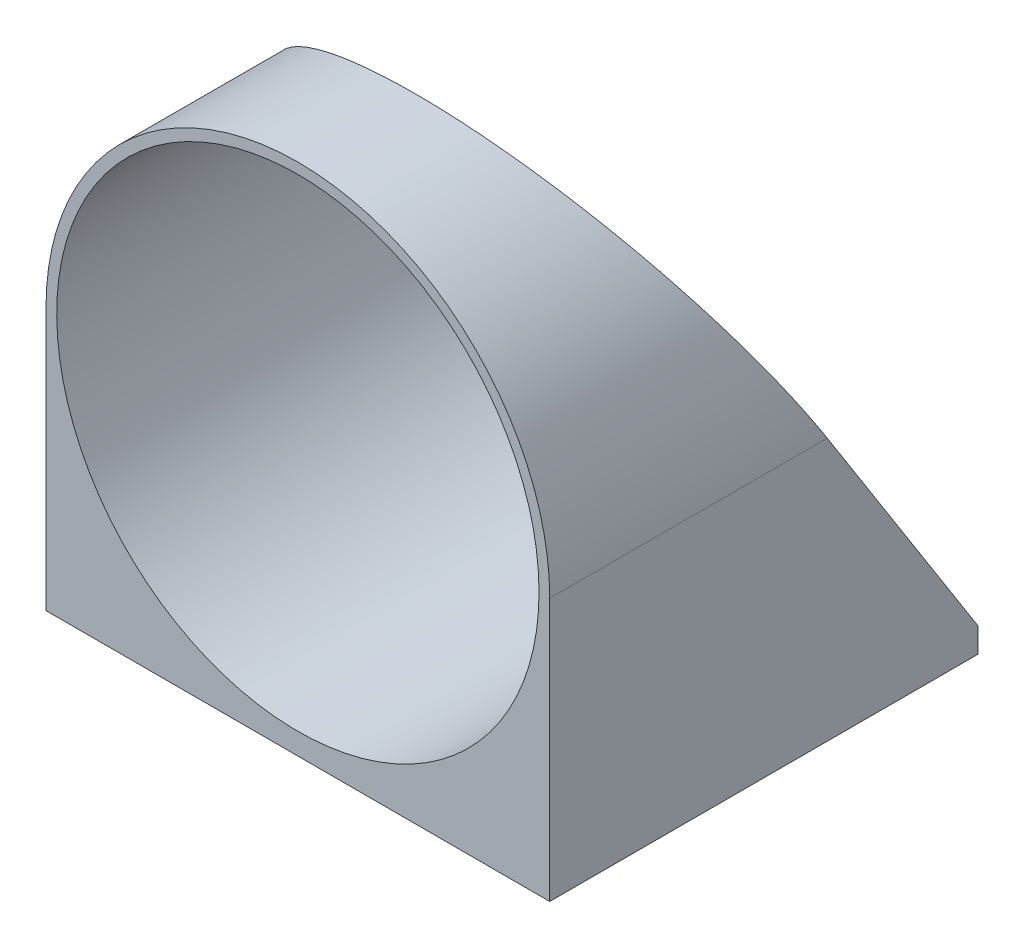
ISO-10303-21;
HEADER;
FILE_DESCRIPTION(('STEP AP214'),'2;1');
FILE_NAME('part.step','',(''),(''),'','','');
FILE_SCHEMA(('AUTOMOTIVE_DESIGN { 1 0 10303 214 1 1 1 1 }'));
ENDSEC;
DATA;
#1=APPLICATION_CONTEXT('core data for automotive mechanical design processes');
#2=APPLICATION_PROTOCOL_DEFINITION('international standard','automotive_design',2000,#1);
#3=PRODUCT_CONTEXT('',#1,'mechanical');
#4=PRODUCT('Part','Part','',(#3));
#5=PRODUCT_RELATED_PRODUCT_CATEGORY('part','',(#4));
#6=PRODUCT_DEFINITION_FORMATION('','',#4);
#7=PRODUCT_DEFINITION_CONTEXT('part definition',#1,'design');
#8=PRODUCT_DEFINITION('design','',#6,#7);
#9=PRODUCT_DEFINITION_SHAPE('','',#8);
#10=(LENGTH_UNIT() NAMED_UNIT(*) SI_UNIT(.MILLI.,.METRE.));
#11=(NAMED_UNIT(*) PLANE_ANGLE_UNIT() SI_UNIT($,.RADIAN.));
#12=(NAMED_UNIT(*) SI_UNIT($,.STERADIAN.) SOLID_ANGLE_UNIT());
#13=UNCERTAINTY_MEASURE_WITH_UNIT(LENGTH_MEASURE(1.E-05),#10,'distance_accuracy_value','');
#14=(GEOMETRIC_REPRESENTATION_CONTEXT(3) GLOBAL_UNCERTAINTY_ASSIGNED_CONTEXT((#13)) GLOBAL_UNIT_ASSIGNED_CONTEXT((#10,
#11,#12)) REPRESENTATION_CONTEXT('',''));
#15=CARTESIAN_POINT('',(0.,0.,0.));
#16=DIRECTION('',(0.,0.,1.));
#17=DIRECTION('',(1.,0.,0.));
#18=AXIS2_PLACEMENT_3D('',#15,#16,#17);
#19=CARTESIAN_POINT('',(0.,0.,-816.540159845395));
#20=DIRECTION('',(0.,0.,1.));
#21=DIRECTION('',(1.,0.,0.));
#22=AXIS2_PLACEMENT_3D('',#19,#20,#21);
#23=PLANE('',#22);
#24=CARTESIAN_POINT('',(0.,0.,-816.540159845395));
#25=DIRECTION('',(0.,0.,1.));
#26=DIRECTION('',(1.,0.,0.));
#27=AXIS2_PLACEMENT_3D('',#24,#25,#26);
#28=CIRCLE('',#27,23.525);
#29=CARTESIAN_POINT('',(23.525,0.,-816.540159845395));
#30=VERTEX_POINT('',#29);
#31=CARTESIAN_POINT('',(-23.525,0.,-816.540159845395));
#32=VERTEX_POINT('',#31);
#33=EDGE_CURVE('E48',#30,#32,#28,.T.);
#34=ORIENTED_EDGE('',*,*,#33,.T.);
#35=DIRECTION('',(0.,-1.,0.));
#36=VECTOR('',#35,1.);
#37=CARTESIAN_POINT('',(-23.525,0.,-816.540159845395));
#38=LINE('',#37,#36);
#39=CARTESIAN_POINT('',(-23.525,-24.525,-816.540159845395));
#40=VERTEX_POINT('',#39);
#41=EDGE_CURVE('E119',#32,#40,#38,.T.);
#42=ORIENTED_EDGE('',*,*,#41,.T.);
#43=DIRECTION('',(1.,0.,0.));
#44=VECTOR('',#43,1.);
#45=CARTESIAN_POINT('',(0.,-24.525,-816.540159845395));
#46=LINE('',#45,#44);
#47=CARTESIAN_POINT('',(23.525,-24.525,-816.540159845395));
#48=VERTEX_POINT('',#47);
#49=EDGE_CURVE('E114',#40,#48,#46,.T.);
#50=ORIENTED_EDGE('',*,*,#49,.T.);
#51=DIRECTION('',(0.,-1.,0.));
#52=VECTOR('',#51,1.);
#53=CARTESIAN_POINT('',(23.525,0.,-816.540159845395));
#54=LINE('',#53,#52);
#55=EDGE_CURVE('E125',#30,#48,#54,.T.);
#56=ORIENTED_EDGE('',*,*,#55,.F.);
#57=EDGE_LOOP('',(#34,#42,#50,#56));
#58=FACE_BOUND('',#57,.T.);
#59=CARTESIAN_POINT('',(0.,0.,-816.540159845395));
#60=DIRECTION('',(0.,0.,1.));
#61=DIRECTION('',(1.,0.,0.));
#62=AXIS2_PLACEMENT_3D('',#59,#60,#61);
#63=CIRCLE('',#62,22.525);
#64=CARTESIAN_POINT('',(22.525,0.,-816.540159845395));
#65=VERTEX_POINT('',#64);
#66=EDGE_CURVE('E135',#65,#65,#63,.T.);
#67=ORIENTED_EDGE('',*,*,#66,.F.);
#68=EDGE_LOOP('',(#67));
#69=FACE_BOUND('',#68,.T.);
#70=ADVANCED_FACE('F40',(#58,#69),#23,.T.);
#71=CARTESIAN_POINT('',(0.,0.,-856.540159845395));
#72=DIRECTION('',(0.,0.,1.));
#73=DIRECTION('',(1.,0.,0.));
#74=AXIS2_PLACEMENT_3D('',#71,#72,#73);
#75=PLANE('',#74);
#76=DIRECTION('',(0.,-1.,0.));
#77=VECTOR('',#76,1.);
#78=CARTESIAN_POINT('',(-23.525,0.,-856.540159845395));
#79=LINE('',#78,#77);
#80=CARTESIAN_POINT('',(-23.525,-22.225,-856.540159845395));
#81=VERTEX_POINT('',#80);
#82=CARTESIAN_POINT('',(-23.525,-24.525,-856.540159845395));
#83=VERTEX_POINT('',#82);
#84=EDGE_CURVE('E113',#81,#83,#79,.T.);
#85=ORIENTED_EDGE('',*,*,#84,.F.);
#86=DIRECTION('',(1.,0.,0.));
#87=VECTOR('',#86,1.);
#88=CARTESIAN_POINT('',(-23.525,-22.225,-856.540159845395));
#89=LINE('',#88,#87);
#90=CARTESIAN_POINT('',(-3.66401419211228,-22.225,-856.540159845395));
#91=VERTEX_POINT('',#90);
#92=EDGE_CURVE('E54',#81,#91,#89,.T.);
#93=ORIENTED_EDGE('',*,*,#92,.T.);
#94=CARTESIAN_POINT('',(0.,0.,-856.540159845395));
#95=DIRECTION('',(0.,0.,1.));
#96=DIRECTION('',(1.,0.,0.));
#97=AXIS2_PLACEMENT_3D('',#94,#95,#96);
#98=CIRCLE('',#97,22.525);
#99=CARTESIAN_POINT('',(3.66401419211228,-22.225,-856.540159845395));
#100=VERTEX_POINT('',#99);
#101=EDGE_CURVE('E108',#91,#100,#98,.T.);
#102=ORIENTED_EDGE('',*,*,#101,.T.);
#103=CARTESIAN_POINT('',(23.525,-22.225,-856.540159845395));
#104=VERTEX_POINT('',#103);
#105=EDGE_CURVE('E95',#100,#104,#89,.T.);
#106=ORIENTED_EDGE('',*,*,#105,.T.);
#107=DIRECTION('',(0.,-1.,0.));
#108=VECTOR('',#107,1.);
#109=CARTESIAN_POINT('',(23.525,0.,-856.540159845395));
#110=LINE('',#109,#108);
#111=CARTESIAN_POINT('',(23.525,-24.525,-856.540159845395));
#112=VERTEX_POINT('',#111);
#113=EDGE_CURVE('E105',#104,#112,#110,.T.);
#114=ORIENTED_EDGE('',*,*,#113,.T.);
#115=DIRECTION('',(1.,0.,0.));
#116=VECTOR('',#115,1.);
#117=CARTESIAN_POINT('',(0.,-24.525,-856.540159845395));
#118=LINE('',#117,#116);
#119=EDGE_CURVE('E116',#83,#112,#118,.T.);
#120=ORIENTED_EDGE('',*,*,#119,.F.);
#121=EDGE_LOOP('',(#85,#93,#102,#106,#114,#120));
#122=FACE_BOUND('',#121,.T.);
#123=ADVANCED_FACE('F103',(#122),#75,.F.);
#124=CARTESIAN_POINT('',(0.,0.,-816.540159845395));
#125=DIRECTION('',(0.,0.,-1.));
#126=DIRECTION('',(-1.,0.,0.));
#127=AXIS2_PLACEMENT_3D('',#124,#125,#126);
#128=CYLINDRICAL_SURFACE('',#127,23.525);
#129=DIRECTION('',(0.,0.,1.));
#130=VECTOR('',#129,1.);
#131=CARTESIAN_POINT('',(23.525,0.,-856.540159845395));
#132=LINE('',#131,#130);
#133=CARTESIAN_POINT('',(23.525,0.,-842.453482286827));
#134=VERTEX_POINT('',#133);
#135=EDGE_CURVE('E62',#134,#30,#132,.T.);
#136=ORIENTED_EDGE('',*,*,#135,.F.);
#137=CARTESIAN_POINT('',(0.,0.,-842.453482286827));
#138=DIRECTION('',(0.,-0.535346187403037,0.844632736538806));
#139=DIRECTION('',(0.,-0.844632736538806,-0.535346187403037));
#140=AXIS2_PLACEMENT_3D('',#137,#138,#139);
#141=ELLIPSE('',#140,27.8523421865015,23.525);
#142=CARTESIAN_POINT('',(-23.525,0.,-842.453482286827));
#143=VERTEX_POINT('',#142);
#144=EDGE_CURVE('E97',#134,#143,#141,.T.);
#145=ORIENTED_EDGE('',*,*,#144,.T.);
#146=DIRECTION('',(0.,0.,1.));
#147=VECTOR('',#146,1.);
#148=CARTESIAN_POINT('',(-23.525,0.,-856.540159845395));
#149=LINE('',#148,#147);
#150=EDGE_CURVE('E132',#143,#32,#149,.T.);
#151=ORIENTED_EDGE('',*,*,#150,.T.);
#152=ORIENTED_EDGE('',*,*,#33,.F.);
#153=EDGE_LOOP('',(#136,#145,#151,#152));
#154=FACE_BOUND('',#153,.T.);
#155=ADVANCED_FACE('F42',(#154),#128,.T.);
#156=CARTESIAN_POINT('',(0.,0.,-816.540159845395));
#157=DIRECTION('',(0.,0.,-1.));
#158=DIRECTION('',(-1.,0.,0.));
#159=AXIS2_PLACEMENT_3D('',#156,#157,#158);
#160=CYLINDRICAL_SURFACE('',#159,22.525);
#161=CARTESIAN_POINT('',(0.,0.,-842.453482286827));
#162=DIRECTION('',(0.,-0.535346187403037,0.844632736538806));
#163=DIRECTION('',(0.,-0.844632736538806,-0.535346187403037));
#164=AXIS2_PLACEMENT_3D('',#161,#162,#163);
#165=ELLIPSE('',#164,26.6683956536003,22.525);
#166=EDGE_CURVE('E151',#100,#91,#165,.T.);
#167=ORIENTED_EDGE('',*,*,#166,.F.);
#168=ORIENTED_EDGE('',*,*,#101,.F.);
#169=EDGE_LOOP('',(#167,#168));
#170=FACE_BOUND('',#169,.T.);
#171=ORIENTED_EDGE('',*,*,#66,.T.);
#172=EDGE_LOOP('',(#171));
#173=FACE_BOUND('',#172,.T.);
#174=ADVANCED_FACE('F153',(#170,#173),#160,.F.);
#175=CARTESIAN_POINT('',(23.525,0.,-856.540159845395));
#176=DIRECTION('',(-1.,0.,0.));
#177=DIRECTION('',(0.,0.,1.));
#178=AXIS2_PLACEMENT_3D('',#175,#176,#177);
#179=PLANE('',#178);
#180=ORIENTED_EDGE('',*,*,#113,.F.);
#181=DIRECTION('',(0.,-0.844632736538806,-0.535346187403037));
#182=VECTOR('',#181,1.);
#183=CARTESIAN_POINT('',(23.525,23.525,-827.542837087039));
#184=LINE('',#183,#182);
#185=EDGE_CURVE('E92',#134,#104,#184,.T.);
#186=ORIENTED_EDGE('',*,*,#185,.F.);
#187=ORIENTED_EDGE('',*,*,#135,.T.);
#188=ORIENTED_EDGE('',*,*,#55,.T.);
#189=DIRECTION('',(0.,0.,1.));
#190=VECTOR('',#189,1.);
#191=CARTESIAN_POINT('',(23.525,-24.525,-856.540159845395));
#192=LINE('',#191,#190);
#193=EDGE_CURVE('E111',#112,#48,#192,.T.);
#194=ORIENTED_EDGE('',*,*,#193,.F.);
#195=EDGE_LOOP('',(#180,#186,#187,#188,#194));
#196=FACE_BOUND('',#195,.T.);
#197=ADVANCED_FACE('F110',(#196),#179,.F.);
#198=CARTESIAN_POINT('',(0.,-24.525,-856.540159845395));
#199=DIRECTION('',(0.,-1.,0.));
#200=DIRECTION('',(0.,0.,-1.));
#201=AXIS2_PLACEMENT_3D('',#198,#199,#200);
#202=PLANE('',#201);
#203=ORIENTED_EDGE('',*,*,#49,.F.);
#204=DIRECTION('',(0.,0.,1.));
#205=VECTOR('',#204,1.);
#206=CARTESIAN_POINT('',(-23.525,-24.525,-856.540159845395));
#207=LINE('',#206,#205);
#208=EDGE_CURVE('E130',#83,#40,#207,.T.);
#209=ORIENTED_EDGE('',*,*,#208,.F.);
#210=ORIENTED_EDGE('',*,*,#119,.T.);
#211=ORIENTED_EDGE('',*,*,#193,.T.);
#212=EDGE_LOOP('',(#203,#209,#210,#211));
#213=FACE_BOUND('',#212,.T.);
#214=ADVANCED_FACE('F150',(#213),#202,.T.);
#215=CARTESIAN_POINT('',(-23.525,0.,-856.540159845395));
#216=DIRECTION('',(-1.,0.,0.));
#217=DIRECTION('',(0.,0.,1.));
#218=AXIS2_PLACEMENT_3D('',#215,#216,#217);
#219=PLANE('',#218);
#220=DIRECTION('',(0.,0.844632736538806,0.535346187403037));
#221=VECTOR('',#220,1.);
#222=CARTESIAN_POINT('',(-23.525,-6.36958588465585,-846.4906612537));
#223=LINE('',#222,#221);
#224=EDGE_CURVE('E11',#81,#143,#223,.T.);
#225=ORIENTED_EDGE('',*,*,#224,.F.);
#226=ORIENTED_EDGE('',*,*,#84,.T.);
#227=ORIENTED_EDGE('',*,*,#208,.T.);
#228=ORIENTED_EDGE('',*,*,#41,.F.);
#229=ORIENTED_EDGE('',*,*,#150,.F.);
#230=EDGE_LOOP('',(#225,#226,#227,#228,#229));
#231=FACE_BOUND('',#230,.T.);
#232=ADVANCED_FACE('F147',(#231),#219,.T.);
#233=CARTESIAN_POINT('',(-23.525,23.525,-827.542837087039));
#234=DIRECTION('',(0.,-0.535346187403037,0.844632736538806));
#235=DIRECTION('',(0.,-0.844632736538806,-0.535346187403037));
#236=AXIS2_PLACEMENT_3D('',#233,#234,#235);
#237=PLANE('',#236);
#238=ORIENTED_EDGE('',*,*,#185,.T.);
#239=ORIENTED_EDGE('',*,*,#105,.F.);
#240=ORIENTED_EDGE('',*,*,#166,.T.);
#241=ORIENTED_EDGE('',*,*,#92,.F.);
#242=ORIENTED_EDGE('',*,*,#224,.T.);
#243=ORIENTED_EDGE('',*,*,#144,.F.);
#244=EDGE_LOOP('',(#238,#239,#240,#241,#242,#243));
#245=FACE_BOUND('',#244,.T.);
#246=ADVANCED_FACE('F94',(#245),#237,.F.);
#247=CLOSED_SHELL('',(#70,#123,#155,#174,#197,#214,#232,#246));
#248=MANIFOLD_SOLID_BREP('B2',#247);
#249=ADVANCED_BREP_SHAPE_REPRESENTATION('',(#18,#248),#14);
#250=SHAPE_DEFINITION_REPRESENTATION(#9,#249);
ENDSEC;
END-ISO-10303-21;
